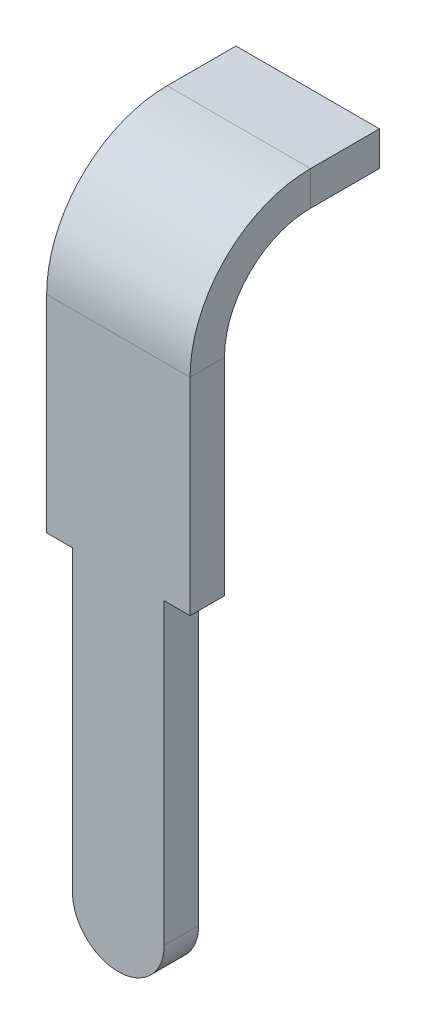
ISO-10303-21;
HEADER;
FILE_DESCRIPTION(('STEP AP214'),'2;1');
FILE_NAME('part.step','',(''),(''),'','','');
FILE_SCHEMA(('AUTOMOTIVE_DESIGN { 1 0 10303 214 1 1 1 1 }'));
ENDSEC;
DATA;
#1=APPLICATION_CONTEXT('core data for automotive mechanical design processes');
#2=APPLICATION_PROTOCOL_DEFINITION('international standard','automotive_design',2000,#1);
#3=PRODUCT_CONTEXT('',#1,'mechanical');
#4=PRODUCT('Part','Part','',(#3));
#5=PRODUCT_RELATED_PRODUCT_CATEGORY('part','',(#4));
#6=PRODUCT_DEFINITION_FORMATION('','',#4);
#7=PRODUCT_DEFINITION_CONTEXT('part definition',#1,'design');
#8=PRODUCT_DEFINITION('design','',#6,#7);
#9=PRODUCT_DEFINITION_SHAPE('','',#8);
#10=(LENGTH_UNIT() NAMED_UNIT(*) SI_UNIT(.MILLI.,.METRE.));
#11=(NAMED_UNIT(*) PLANE_ANGLE_UNIT() SI_UNIT($,.RADIAN.));
#12=(NAMED_UNIT(*) SI_UNIT($,.STERADIAN.) SOLID_ANGLE_UNIT());
#13=UNCERTAINTY_MEASURE_WITH_UNIT(LENGTH_MEASURE(1.E-05),#10,'distance_accuracy_value','');
#14=(GEOMETRIC_REPRESENTATION_CONTEXT(3) GLOBAL_UNCERTAINTY_ASSIGNED_CONTEXT((#13)) GLOBAL_UNIT_ASSIGNED_CONTEXT((#10,
#11,#12)) REPRESENTATION_CONTEXT('',''));
#15=CARTESIAN_POINT('',(0.,0.,0.));
#16=DIRECTION('',(0.,0.,1.));
#17=DIRECTION('',(1.,0.,0.));
#18=AXIS2_PLACEMENT_3D('',#15,#16,#17);
#19=CARTESIAN_POINT('',(-2.5,-4.3,-5.5));
#20=DIRECTION('',(0.,0.,1.));
#21=DIRECTION('',(0.,-1.,0.));
#22=AXIS2_PLACEMENT_3D('',#19,#20,#21);
#23=CYLINDRICAL_SURFACE('',#22,0.4);
#24=CARTESIAN_POINT('',(-2.5,-4.3,7.15));
#25=DIRECTION('',(0.,0.,1.));
#26=DIRECTION('',(1.,0.,0.));
#27=AXIS2_PLACEMENT_3D('',#24,#25,#26);
#28=CIRCLE('',#27,0.4);
#29=CARTESIAN_POINT('',(-2.5,-4.7,7.15));
#30=VERTEX_POINT('',#29);
#31=CARTESIAN_POINT('',(-2.1,-4.3,7.15));
#32=VERTEX_POINT('',#31);
#33=EDGE_CURVE('E180',#30,#32,#28,.T.);
#34=ORIENTED_EDGE('',*,*,#33,.F.);
#35=DIRECTION('',(0.,0.,-1.));
#36=VECTOR('',#35,1.);
#37=CARTESIAN_POINT('',(-2.5,-4.7,6.85));
#38=LINE('',#37,#36);
#39=CARTESIAN_POINT('',(-2.5,-4.7,6.85));
#40=VERTEX_POINT('',#39);
#41=EDGE_CURVE('E11',#30,#40,#38,.T.);
#42=ORIENTED_EDGE('',*,*,#41,.T.);
#43=CARTESIAN_POINT('',(-2.5,-4.3,6.85));
#44=DIRECTION('',(0.,0.,-1.));
#45=DIRECTION('',(-1.,0.,0.));
#46=AXIS2_PLACEMENT_3D('',#43,#44,#45);
#47=CIRCLE('',#46,0.4);
#48=CARTESIAN_POINT('',(-2.1,-4.3,6.85));
#49=VERTEX_POINT('',#48);
#50=EDGE_CURVE('E281',#49,#40,#47,.T.);
#51=ORIENTED_EDGE('',*,*,#50,.F.);
#52=DIRECTION('',(0.,0.,-1.));
#53=VECTOR('',#52,1.);
#54=CARTESIAN_POINT('',(-2.1,-4.3,6.85));
#55=LINE('',#54,#53);
#56=EDGE_CURVE('E117',#32,#49,#55,.T.);
#57=ORIENTED_EDGE('',*,*,#56,.F.);
#58=EDGE_LOOP('',(#34,#42,#51,#57));
#59=FACE_BOUND('',#58,.T.);
#60=ADVANCED_FACE('F17',(#59),#23,.T.);
#61=CARTESIAN_POINT('',(-2.5,-4.3,-5.5));
#62=DIRECTION('',(0.,0.,-1.));
#63=DIRECTION('',(0.,1.,0.));
#64=AXIS2_PLACEMENT_3D('',#61,#62,#63);
#65=CYLINDRICAL_SURFACE('',#64,0.4);
#66=ORIENTED_EDGE('',*,*,#41,.F.);
#67=CARTESIAN_POINT('',(-2.5,-4.3,7.15));
#68=DIRECTION('',(0.,0.,1.));
#69=DIRECTION('',(1.,0.,0.));
#70=AXIS2_PLACEMENT_3D('',#67,#68,#69);
#71=CIRCLE('',#70,0.4);
#72=CARTESIAN_POINT('',(-2.9,-4.3,7.15));
#73=VERTEX_POINT('',#72);
#74=EDGE_CURVE('E176',#73,#30,#71,.T.);
#75=ORIENTED_EDGE('',*,*,#74,.F.);
#76=DIRECTION('',(0.,0.,1.));
#77=VECTOR('',#76,1.);
#78=CARTESIAN_POINT('',(-2.9,-4.3,7.15));
#79=LINE('',#78,#77);
#80=CARTESIAN_POINT('',(-2.9,-4.3,6.85));
#81=VERTEX_POINT('',#80);
#82=EDGE_CURVE('E20',#81,#73,#79,.T.);
#83=ORIENTED_EDGE('',*,*,#82,.F.);
#84=CARTESIAN_POINT('',(-2.5,-4.3,6.85));
#85=DIRECTION('',(0.,0.,-1.));
#86=DIRECTION('',(-1.,0.,0.));
#87=AXIS2_PLACEMENT_3D('',#84,#85,#86);
#88=CIRCLE('',#87,0.4);
#89=EDGE_CURVE('E151',#40,#81,#88,.T.);
#90=ORIENTED_EDGE('',*,*,#89,.F.);
#91=EDGE_LOOP('',(#66,#75,#83,#90));
#92=FACE_BOUND('',#91,.T.);
#93=ADVANCED_FACE('F364',(#92),#65,.T.);
#94=CARTESIAN_POINT('',(-2.9,-4.7,-5.5));
#95=DIRECTION('',(1.,0.,0.));
#96=DIRECTION('',(0.,1.,0.));
#97=AXIS2_PLACEMENT_3D('',#94,#95,#96);
#98=PLANE('',#97);
#99=DIRECTION('',(0.,-1.,0.));
#100=VECTOR('',#99,1.);
#101=CARTESIAN_POINT('',(-2.9,0.1,6.85));
#102=LINE('',#101,#100);
#103=CARTESIAN_POINT('',(-2.9,-1.7,6.85));
#104=VERTEX_POINT('',#103);
#105=EDGE_CURVE('E147',#104,#81,#102,.T.);
#106=ORIENTED_EDGE('',*,*,#105,.T.);
#107=ORIENTED_EDGE('',*,*,#82,.T.);
#108=DIRECTION('',(0.,1.,0.));
#109=VECTOR('',#108,1.);
#110=CARTESIAN_POINT('',(-2.9,-4.7,7.15));
#111=LINE('',#110,#109);
#112=CARTESIAN_POINT('',(-2.9,-1.7,7.15));
#113=VERTEX_POINT('',#112);
#114=EDGE_CURVE('E206',#73,#113,#111,.T.);
#115=ORIENTED_EDGE('',*,*,#114,.T.);
#116=DIRECTION('',(0.,0.,1.));
#117=VECTOR('',#116,1.);
#118=CARTESIAN_POINT('',(-2.9,-1.7,-5.5));
#119=LINE('',#118,#117);
#120=EDGE_CURVE('E121',#104,#113,#119,.T.);
#121=ORIENTED_EDGE('',*,*,#120,.F.);
#122=EDGE_LOOP('',(#106,#107,#115,#121));
#123=FACE_BOUND('',#122,.T.);
#124=ADVANCED_FACE('F361',(#123),#98,.F.);
#125=CARTESIAN_POINT('',(-3.125,-1.7,-5.5));
#126=DIRECTION('',(0.,1.,0.));
#127=DIRECTION('',(1.,0.,0.));
#128=AXIS2_PLACEMENT_3D('',#125,#126,#127);
#129=PLANE('',#128);
#130=DIRECTION('',(1.,0.,0.));
#131=VECTOR('',#130,1.);
#132=CARTESIAN_POINT('',(-1.875,-1.7,6.85));
#133=LINE('',#132,#131);
#134=CARTESIAN_POINT('',(-3.125,-1.7,6.85));
#135=VERTEX_POINT('',#134);
#136=EDGE_CURVE('E150',#135,#104,#133,.T.);
#137=ORIENTED_EDGE('',*,*,#136,.T.);
#138=ORIENTED_EDGE('',*,*,#120,.T.);
#139=DIRECTION('',(-1.,0.,0.));
#140=VECTOR('',#139,1.);
#141=CARTESIAN_POINT('',(-3.125,-1.7,7.15));
#142=LINE('',#141,#140);
#143=CARTESIAN_POINT('',(-3.125,-1.7,7.15));
#144=VERTEX_POINT('',#143);
#145=EDGE_CURVE('E203',#113,#144,#142,.T.);
#146=ORIENTED_EDGE('',*,*,#145,.T.);
#147=DIRECTION('',(0.,0.,1.));
#148=VECTOR('',#147,1.);
#149=CARTESIAN_POINT('',(-3.125,-1.7,-5.5));
#150=LINE('',#149,#148);
#151=EDGE_CURVE('E209',#135,#144,#150,.T.);
#152=ORIENTED_EDGE('',*,*,#151,.F.);
#153=EDGE_LOOP('',(#137,#138,#146,#152));
#154=FACE_BOUND('',#153,.T.);
#155=ADVANCED_FACE('F376',(#154),#129,.F.);
#156=CARTESIAN_POINT('',(-1.875,-1.7,-5.5));
#157=DIRECTION('',(0.,1.,0.));
#158=DIRECTION('',(1.,0.,0.));
#159=AXIS2_PLACEMENT_3D('',#156,#157,#158);
#160=PLANE('',#159);
#161=DIRECTION('',(1.,0.,0.));
#162=VECTOR('',#161,1.);
#163=CARTESIAN_POINT('',(-1.875,-1.7,6.85));
#164=LINE('',#163,#162);
#165=CARTESIAN_POINT('',(-2.1,-1.7,6.85));
#166=VERTEX_POINT('',#165);
#167=CARTESIAN_POINT('',(-1.875,-1.7,6.85));
#168=VERTEX_POINT('',#167);
#169=EDGE_CURVE('E168',#166,#168,#164,.T.);
#170=ORIENTED_EDGE('',*,*,#169,.T.);
#171=DIRECTION('',(0.,0.,1.));
#172=VECTOR('',#171,1.);
#173=CARTESIAN_POINT('',(-1.875,-1.7,-5.5));
#174=LINE('',#173,#172);
#175=CARTESIAN_POINT('',(-1.875,-1.7,7.15));
#176=VERTEX_POINT('',#175);
#177=EDGE_CURVE('E172',#168,#176,#174,.T.);
#178=ORIENTED_EDGE('',*,*,#177,.T.);
#179=DIRECTION('',(-1.,0.,0.));
#180=VECTOR('',#179,1.);
#181=CARTESIAN_POINT('',(-1.875,-1.7,7.15));
#182=LINE('',#181,#180);
#183=CARTESIAN_POINT('',(-2.1,-1.7,7.15));
#184=VERTEX_POINT('',#183);
#185=EDGE_CURVE('E155',#176,#184,#182,.T.);
#186=ORIENTED_EDGE('',*,*,#185,.T.);
#187=DIRECTION('',(0.,0.,1.));
#188=VECTOR('',#187,1.);
#189=CARTESIAN_POINT('',(-2.1,-1.7,-5.5));
#190=LINE('',#189,#188);
#191=EDGE_CURVE('E120',#166,#184,#190,.T.);
#192=ORIENTED_EDGE('',*,*,#191,.F.);
#193=EDGE_LOOP('',(#170,#178,#186,#192));
#194=FACE_BOUND('',#193,.T.);
#195=ADVANCED_FACE('F367',(#194),#160,.F.);
#196=CARTESIAN_POINT('',(-2.1,-4.7,-5.5));
#197=DIRECTION('',(-1.,0.,0.));
#198=DIRECTION('',(0.,0.,1.));
#199=AXIS2_PLACEMENT_3D('',#196,#197,#198);
#200=PLANE('',#199);
#201=DIRECTION('',(0.,-1.,0.));
#202=VECTOR('',#201,1.);
#203=CARTESIAN_POINT('',(-2.1,-4.7,7.15));
#204=LINE('',#203,#202);
#205=EDGE_CURVE('E159',#184,#32,#204,.T.);
#206=ORIENTED_EDGE('',*,*,#205,.T.);
#207=ORIENTED_EDGE('',*,*,#56,.T.);
#208=DIRECTION('',(0.,1.,0.));
#209=VECTOR('',#208,1.);
#210=CARTESIAN_POINT('',(-2.1,0.1,6.85));
#211=LINE('',#210,#209);
#212=EDGE_CURVE('E285',#49,#166,#211,.T.);
#213=ORIENTED_EDGE('',*,*,#212,.T.);
#214=ORIENTED_EDGE('',*,*,#191,.T.);
#215=EDGE_LOOP('',(#206,#207,#213,#214));
#216=FACE_BOUND('',#215,.T.);
#217=ADVANCED_FACE('F365',(#216),#200,.F.);
#218=CARTESIAN_POINT('',(0.,0.,5.5));
#219=DIRECTION('',(0.,0.,1.));
#220=DIRECTION('',(1.,0.,0.));
#221=AXIS2_PLACEMENT_3D('',#218,#219,#220);
#222=PLANE('',#221);
#223=DIRECTION('',(0.,-1.,0.));
#224=VECTOR('',#223,1.);
#225=CARTESIAN_POINT('',(-3.125,0.85,5.5));
#226=LINE('',#225,#224);
#227=CARTESIAN_POINT('',(-3.125,1.15,5.5));
#228=VERTEX_POINT('',#227);
#229=CARTESIAN_POINT('',(-3.125,0.85,5.5));
#230=VERTEX_POINT('',#229);
#231=EDGE_CURVE('E76',#228,#230,#226,.T.);
#232=ORIENTED_EDGE('',*,*,#231,.F.);
#233=DIRECTION('',(-1.,0.,0.));
#234=VECTOR('',#233,1.);
#235=CARTESIAN_POINT('',(-1.875,1.15,5.5));
#236=LINE('',#235,#234);
#237=CARTESIAN_POINT('',(-1.875,1.15,5.5));
#238=VERTEX_POINT('',#237);
#239=EDGE_CURVE('E39',#238,#228,#236,.T.);
#240=ORIENTED_EDGE('',*,*,#239,.F.);
#241=DIRECTION('',(0.,1.,0.));
#242=VECTOR('',#241,1.);
#243=CARTESIAN_POINT('',(-1.875,0.85,5.5));
#244=LINE('',#243,#242);
#245=CARTESIAN_POINT('',(-1.875,0.85,5.5));
#246=VERTEX_POINT('',#245);
#247=EDGE_CURVE('E78',#246,#238,#244,.T.);
#248=ORIENTED_EDGE('',*,*,#247,.F.);
#249=DIRECTION('',(1.,0.,0.));
#250=VECTOR('',#249,1.);
#251=CARTESIAN_POINT('',(-1.875,0.85,5.5));
#252=LINE('',#251,#250);
#253=EDGE_CURVE('E72',#230,#246,#252,.T.);
#254=ORIENTED_EDGE('',*,*,#253,.F.);
#255=EDGE_LOOP('',(#232,#240,#248,#254));
#256=FACE_BOUND('',#255,.T.);
#257=ADVANCED_FACE('F74',(#256),#222,.F.);
#258=CARTESIAN_POINT('',(-1.875,1.15,6.1));
#259=DIRECTION('',(0.,-1.,0.));
#260=DIRECTION('',(0.,0.,-1.));
#261=AXIS2_PLACEMENT_3D('',#258,#259,#260);
#262=PLANE('',#261);
#263=ORIENTED_EDGE('',*,*,#239,.T.);
#264=DIRECTION('',(0.,0.,-1.));
#265=VECTOR('',#264,1.);
#266=CARTESIAN_POINT('',(-3.125,1.15,6.1));
#267=LINE('',#266,#265);
#268=CARTESIAN_POINT('',(-3.125,1.15,6.1));
#269=VERTEX_POINT('',#268);
#270=EDGE_CURVE('E83',#269,#228,#267,.T.);
#271=ORIENTED_EDGE('',*,*,#270,.F.);
#272=DIRECTION('',(-1.,0.,0.));
#273=VECTOR('',#272,1.);
#274=CARTESIAN_POINT('',(-1.875,1.15,6.1));
#275=LINE('',#274,#273);
#276=CARTESIAN_POINT('',(-1.875,1.15,6.1));
#277=VERTEX_POINT('',#276);
#278=EDGE_CURVE('E229',#277,#269,#275,.T.);
#279=ORIENTED_EDGE('',*,*,#278,.F.);
#280=DIRECTION('',(0.,0.,-1.));
#281=VECTOR('',#280,1.);
#282=CARTESIAN_POINT('',(-1.875,1.15,6.1));
#283=LINE('',#282,#281);
#284=EDGE_CURVE('E112',#277,#238,#283,.T.);
#285=ORIENTED_EDGE('',*,*,#284,.T.);
#286=EDGE_LOOP('',(#263,#271,#279,#285));
#287=FACE_BOUND('',#286,.T.);
#288=ADVANCED_FACE('F374',(#287),#262,.F.);
#289=CARTESIAN_POINT('',(-1.875,0.85,6.1));
#290=DIRECTION('',(-1.,0.,0.));
#291=DIRECTION('',(0.,0.,1.));
#292=AXIS2_PLACEMENT_3D('',#289,#290,#291);
#293=PLANE('',#292);
#294=ORIENTED_EDGE('',*,*,#247,.T.);
#295=ORIENTED_EDGE('',*,*,#284,.F.);
#296=DIRECTION('',(0.,1.,0.));
#297=VECTOR('',#296,1.);
#298=CARTESIAN_POINT('',(-1.875,0.85,6.1));
#299=LINE('',#298,#297);
#300=CARTESIAN_POINT('',(-1.875,0.85,6.1));
#301=VERTEX_POINT('',#300);
#302=EDGE_CURVE('E192',#301,#277,#299,.T.);
#303=ORIENTED_EDGE('',*,*,#302,.F.);
#304=DIRECTION('',(0.,0.,-1.));
#305=VECTOR('',#304,1.);
#306=CARTESIAN_POINT('',(-1.875,0.85,6.1));
#307=LINE('',#306,#305);
#308=EDGE_CURVE('E82',#301,#246,#307,.T.);
#309=ORIENTED_EDGE('',*,*,#308,.T.);
#310=EDGE_LOOP('',(#294,#295,#303,#309));
#311=FACE_BOUND('',#310,.T.);
#312=ADVANCED_FACE('F393',(#311),#293,.F.);
#313=CARTESIAN_POINT('',(-1.875,0.85,6.1));
#314=DIRECTION('',(0.,1.,0.));
#315=DIRECTION('',(1.,0.,0.));
#316=AXIS2_PLACEMENT_3D('',#313,#314,#315);
#317=PLANE('',#316);
#318=ORIENTED_EDGE('',*,*,#253,.T.);
#319=ORIENTED_EDGE('',*,*,#308,.F.);
#320=DIRECTION('',(1.,0.,0.));
#321=VECTOR('',#320,1.);
#322=CARTESIAN_POINT('',(-1.875,0.85,6.1));
#323=LINE('',#322,#321);
#324=CARTESIAN_POINT('',(-3.125,0.85,6.1));
#325=VERTEX_POINT('',#324);
#326=EDGE_CURVE('E89',#325,#301,#323,.T.);
#327=ORIENTED_EDGE('',*,*,#326,.F.);
#328=DIRECTION('',(0.,0.,-1.));
#329=VECTOR('',#328,1.);
#330=CARTESIAN_POINT('',(-3.125,0.85,6.1));
#331=LINE('',#330,#329);
#332=EDGE_CURVE('E86',#325,#230,#331,.T.);
#333=ORIENTED_EDGE('',*,*,#332,.T.);
#334=EDGE_LOOP('',(#318,#319,#327,#333));
#335=FACE_BOUND('',#334,.T.);
#336=ADVANCED_FACE('F87',(#335),#317,.F.);
#337=CARTESIAN_POINT('',(-3.125,0.85,6.1));
#338=DIRECTION('',(1.,0.,0.));
#339=DIRECTION('',(0.,1.,0.));
#340=AXIS2_PLACEMENT_3D('',#337,#338,#339);
#341=PLANE('',#340);
#342=ORIENTED_EDGE('',*,*,#231,.T.);
#343=ORIENTED_EDGE('',*,*,#332,.F.);
#344=DIRECTION('',(0.,-1.,0.));
#345=VECTOR('',#344,1.);
#346=CARTESIAN_POINT('',(-3.125,0.85,6.1));
#347=LINE('',#346,#345);
#348=EDGE_CURVE('E98',#269,#325,#347,.T.);
#349=ORIENTED_EDGE('',*,*,#348,.F.);
#350=ORIENTED_EDGE('',*,*,#270,.T.);
#351=EDGE_LOOP('',(#342,#343,#349,#350));
#352=FACE_BOUND('',#351,.T.);
#353=ADVANCED_FACE('F96',(#352),#341,.F.);
#354=CARTESIAN_POINT('',(-3.125,0.85,6.1));
#355=DIRECTION('',(-1.,0.,0.));
#356=DIRECTION('',(0.,0.,1.));
#357=AXIS2_PLACEMENT_3D('',#354,#355,#356);
#358=PLANE('',#357);
#359=ORIENTED_EDGE('',*,*,#348,.T.);
#360=CARTESIAN_POINT('',(-3.125,0.1,6.1));
#361=DIRECTION('',(1.,0.,0.));
#362=DIRECTION('',(0.,0.,-1.));
#363=AXIS2_PLACEMENT_3D('',#360,#361,#362);
#364=CIRCLE('',#363,0.75);
#365=CARTESIAN_POINT('',(-3.125,0.1,6.85));
#366=VERTEX_POINT('',#365);
#367=EDGE_CURVE('E188',#325,#366,#364,.T.);
#368=ORIENTED_EDGE('',*,*,#367,.T.);
#369=DIRECTION('',(0.,0.,-1.));
#370=VECTOR('',#369,1.);
#371=CARTESIAN_POINT('',(-3.125,0.1,6.85));
#372=LINE('',#371,#370);
#373=CARTESIAN_POINT('',(-3.125,0.09999999999999,7.15));
#374=VERTEX_POINT('',#373);
#375=EDGE_CURVE('E212',#374,#366,#372,.T.);
#376=ORIENTED_EDGE('',*,*,#375,.F.);
#377=CARTESIAN_POINT('',(-3.125,0.1,6.1));
#378=DIRECTION('',(1.,0.,0.));
#379=DIRECTION('',(0.,0.,-1.));
#380=AXIS2_PLACEMENT_3D('',#377,#378,#379);
#381=CIRCLE('',#380,1.05);
#382=EDGE_CURVE('E103',#269,#374,#381,.T.);
#383=ORIENTED_EDGE('',*,*,#382,.F.);
#384=EDGE_LOOP('',(#359,#368,#376,#383));
#385=FACE_BOUND('',#384,.T.);
#386=ADVANCED_FACE('F248',(#385),#358,.T.);
#387=CARTESIAN_POINT('',(0.,0.1,6.1));
#388=DIRECTION('',(1.,0.,0.));
#389=DIRECTION('',(0.,0.,-1.));
#390=AXIS2_PLACEMENT_3D('',#387,#388,#389);
#391=CYLINDRICAL_SURFACE('',#390,1.05);
#392=ORIENTED_EDGE('',*,*,#278,.T.);
#393=ORIENTED_EDGE('',*,*,#382,.T.);
#394=DIRECTION('',(-1.,0.,0.));
#395=VECTOR('',#394,1.);
#396=CARTESIAN_POINT('',(-1.875,0.09999999999999,7.15));
#397=LINE('',#396,#395);
#398=CARTESIAN_POINT('',(-1.875,0.09999999999999,7.15));
#399=VERTEX_POINT('',#398);
#400=EDGE_CURVE('E158',#399,#374,#397,.T.);
#401=ORIENTED_EDGE('',*,*,#400,.F.);
#402=CARTESIAN_POINT('',(-1.875,0.1,6.1));
#403=DIRECTION('',(1.,0.,0.));
#404=DIRECTION('',(0.,0.,-1.));
#405=AXIS2_PLACEMENT_3D('',#402,#403,#404);
#406=CIRCLE('',#405,1.05);
#407=EDGE_CURVE('E225',#277,#399,#406,.T.);
#408=ORIENTED_EDGE('',*,*,#407,.F.);
#409=EDGE_LOOP('',(#392,#393,#401,#408));
#410=FACE_BOUND('',#409,.T.);
#411=ADVANCED_FACE('F240',(#410),#391,.T.);
#412=CARTESIAN_POINT('',(-1.875,0.85,6.1));
#413=DIRECTION('',(1.,0.,0.));
#414=DIRECTION('',(0.,1.,0.));
#415=AXIS2_PLACEMENT_3D('',#412,#413,#414);
#416=PLANE('',#415);
#417=ORIENTED_EDGE('',*,*,#302,.T.);
#418=ORIENTED_EDGE('',*,*,#407,.T.);
#419=DIRECTION('',(0.,0.,1.));
#420=VECTOR('',#419,1.);
#421=CARTESIAN_POINT('',(-1.875,0.1,6.85));
#422=LINE('',#421,#420);
#423=CARTESIAN_POINT('',(-1.875,0.1,6.85));
#424=VERTEX_POINT('',#423);
#425=EDGE_CURVE('E145',#424,#399,#422,.T.);
#426=ORIENTED_EDGE('',*,*,#425,.F.);
#427=CARTESIAN_POINT('',(-1.875,0.1,6.1));
#428=DIRECTION('',(1.,0.,0.));
#429=DIRECTION('',(0.,0.,-1.));
#430=AXIS2_PLACEMENT_3D('',#427,#428,#429);
#431=CIRCLE('',#430,0.75);
#432=EDGE_CURVE('E193',#301,#424,#431,.T.);
#433=ORIENTED_EDGE('',*,*,#432,.F.);
#434=EDGE_LOOP('',(#417,#418,#426,#433));
#435=FACE_BOUND('',#434,.T.);
#436=ADVANCED_FACE('F404',(#435),#416,.T.);
#437=CARTESIAN_POINT('',(0.,0.1,6.1));
#438=DIRECTION('',(1.,0.,0.));
#439=DIRECTION('',(0.,0.,-1.));
#440=AXIS2_PLACEMENT_3D('',#437,#438,#439);
#441=CYLINDRICAL_SURFACE('',#440,0.75);
#442=ORIENTED_EDGE('',*,*,#326,.T.);
#443=ORIENTED_EDGE('',*,*,#432,.T.);
#444=DIRECTION('',(1.,0.,0.));
#445=VECTOR('',#444,1.);
#446=CARTESIAN_POINT('',(-1.875,0.1,6.85));
#447=LINE('',#446,#445);
#448=EDGE_CURVE('E162',#366,#424,#447,.T.);
#449=ORIENTED_EDGE('',*,*,#448,.F.);
#450=ORIENTED_EDGE('',*,*,#367,.F.);
#451=EDGE_LOOP('',(#442,#443,#449,#450));
#452=FACE_BOUND('',#451,.T.);
#453=ADVANCED_FACE('F407',(#452),#441,.F.);
#454=CARTESIAN_POINT('',(-3.125,0.1,6.85));
#455=DIRECTION('',(-1.,0.,0.));
#456=DIRECTION('',(0.,0.,1.));
#457=AXIS2_PLACEMENT_3D('',#454,#455,#456);
#458=PLANE('',#457);
#459=ORIENTED_EDGE('',*,*,#151,.T.);
#460=DIRECTION('',(0.,-1.,0.));
#461=VECTOR('',#460,1.);
#462=CARTESIAN_POINT('',(-3.125,0.09999999999999,7.15));
#463=LINE('',#462,#461);
#464=EDGE_CURVE('E199',#374,#144,#463,.T.);
#465=ORIENTED_EDGE('',*,*,#464,.F.);
#466=ORIENTED_EDGE('',*,*,#375,.T.);
#467=DIRECTION('',(0.,-1.,0.));
#468=VECTOR('',#467,1.);
#469=CARTESIAN_POINT('',(-3.125,0.1,6.85));
#470=LINE('',#469,#468);
#471=EDGE_CURVE('E154',#366,#135,#470,.T.);
#472=ORIENTED_EDGE('',*,*,#471,.T.);
#473=EDGE_LOOP('',(#459,#465,#466,#472));
#474=FACE_BOUND('',#473,.T.);
#475=ADVANCED_FACE('F253',(#474),#458,.T.);
#476=CARTESIAN_POINT('',(-1.875,0.09999999999999,7.15));
#477=DIRECTION('',(0.,0.,1.));
#478=DIRECTION('',(1.,0.,0.));
#479=AXIS2_PLACEMENT_3D('',#476,#477,#478);
#480=PLANE('',#479);
#481=ORIENTED_EDGE('',*,*,#74,.T.);
#482=ORIENTED_EDGE('',*,*,#33,.T.);
#483=ORIENTED_EDGE('',*,*,#205,.F.);
#484=ORIENTED_EDGE('',*,*,#185,.F.);
#485=DIRECTION('',(0.,-1.,0.));
#486=VECTOR('',#485,1.);
#487=CARTESIAN_POINT('',(-1.875,0.09999999999999,7.15));
#488=LINE('',#487,#486);
#489=EDGE_CURVE('E181',#399,#176,#488,.T.);
#490=ORIENTED_EDGE('',*,*,#489,.F.);
#491=ORIENTED_EDGE('',*,*,#400,.T.);
#492=ORIENTED_EDGE('',*,*,#464,.T.);
#493=ORIENTED_EDGE('',*,*,#145,.F.);
#494=ORIENTED_EDGE('',*,*,#114,.F.);
#495=EDGE_LOOP('',(#481,#482,#483,#484,#490,#491,#492,#493,#494));
#496=FACE_BOUND('',#495,.T.);
#497=ADVANCED_FACE('F257',(#496),#480,.T.);
#498=CARTESIAN_POINT('',(-1.875,0.1,6.85));
#499=DIRECTION('',(1.,0.,0.));
#500=DIRECTION('',(0.,1.,0.));
#501=AXIS2_PLACEMENT_3D('',#498,#499,#500);
#502=PLANE('',#501);
#503=ORIENTED_EDGE('',*,*,#177,.F.);
#504=DIRECTION('',(0.,-1.,0.));
#505=VECTOR('',#504,1.);
#506=CARTESIAN_POINT('',(-1.875,0.1,6.85));
#507=LINE('',#506,#505);
#508=EDGE_CURVE('E167',#424,#168,#507,.T.);
#509=ORIENTED_EDGE('',*,*,#508,.F.);
#510=ORIENTED_EDGE('',*,*,#425,.T.);
#511=ORIENTED_EDGE('',*,*,#489,.T.);
#512=EDGE_LOOP('',(#503,#509,#510,#511));
#513=FACE_BOUND('',#512,.T.);
#514=ADVANCED_FACE('F269',(#513),#502,.T.);
#515=CARTESIAN_POINT('',(-1.875,0.1,6.85));
#516=DIRECTION('',(0.,0.,-1.));
#517=DIRECTION('',(0.,-1.,0.));
#518=AXIS2_PLACEMENT_3D('',#515,#516,#517);
#519=PLANE('',#518);
#520=ORIENTED_EDGE('',*,*,#212,.F.);
#521=ORIENTED_EDGE('',*,*,#50,.T.);
#522=ORIENTED_EDGE('',*,*,#89,.T.);
#523=ORIENTED_EDGE('',*,*,#105,.F.);
#524=ORIENTED_EDGE('',*,*,#136,.F.);
#525=ORIENTED_EDGE('',*,*,#471,.F.);
#526=ORIENTED_EDGE('',*,*,#448,.T.);
#527=ORIENTED_EDGE('',*,*,#508,.T.);
#528=ORIENTED_EDGE('',*,*,#169,.F.);
#529=EDGE_LOOP('',(#520,#521,#522,#523,#524,#525,#526,#527,#528));
#530=FACE_BOUND('',#529,.T.);
#531=ADVANCED_FACE('F296',(#530),#519,.T.);
#532=CLOSED_SHELL('',(#60,#93,#124,#155,#195,#217,#257,#288,#312,#336,#353,#386,#411,#436,#453,
#475,#497,#514,#531));
#533=MANIFOLD_SOLID_BREP('B1',#532);
#534=ADVANCED_BREP_SHAPE_REPRESENTATION('',(#18,#533),#14);
#535=SHAPE_DEFINITION_REPRESENTATION(#9,#534);
ENDSEC;
END-ISO-10303-21;
